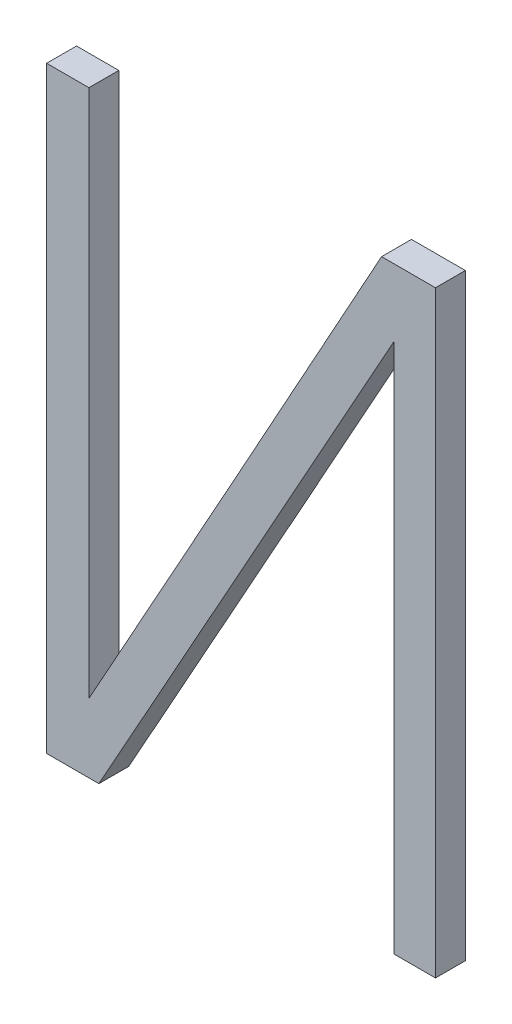
ISO-10303-21;
HEADER;
FILE_DESCRIPTION(('STEP AP214'),'2;1');
FILE_NAME('part.step','',(''),(''),'','','');
FILE_SCHEMA(('AUTOMOTIVE_DESIGN { 1 0 10303 214 1 1 1 1 }'));
ENDSEC;
DATA;
#1=APPLICATION_CONTEXT('core data for automotive mechanical design processes');
#2=APPLICATION_PROTOCOL_DEFINITION('international standard','automotive_design',2000,#1);
#3=PRODUCT_CONTEXT('',#1,'mechanical');
#4=PRODUCT('Part','Part','',(#3));
#5=PRODUCT_RELATED_PRODUCT_CATEGORY('part','',(#4));
#6=PRODUCT_DEFINITION_FORMATION('','',#4);
#7=PRODUCT_DEFINITION_CONTEXT('part definition',#1,'design');
#8=PRODUCT_DEFINITION('design','',#6,#7);
#9=PRODUCT_DEFINITION_SHAPE('','',#8);
#10=(LENGTH_UNIT() NAMED_UNIT(*) SI_UNIT(.MILLI.,.METRE.));
#11=(NAMED_UNIT(*) PLANE_ANGLE_UNIT() SI_UNIT($,.RADIAN.));
#12=(NAMED_UNIT(*) SI_UNIT($,.STERADIAN.) SOLID_ANGLE_UNIT());
#13=UNCERTAINTY_MEASURE_WITH_UNIT(LENGTH_MEASURE(1.E-05),#10,'distance_accuracy_value','');
#14=(GEOMETRIC_REPRESENTATION_CONTEXT(3) GLOBAL_UNCERTAINTY_ASSIGNED_CONTEXT((#13)) GLOBAL_UNIT_ASSIGNED_CONTEXT((#10,
#11,#12)) REPRESENTATION_CONTEXT('',''));
#15=CARTESIAN_POINT('',(0.,0.,0.));
#16=DIRECTION('',(0.,0.,1.));
#17=DIRECTION('',(1.,0.,0.));
#18=AXIS2_PLACEMENT_3D('',#15,#16,#17);
#19=CARTESIAN_POINT('',(70.8180545018474,66.6666929015237,-39.));
#20=DIRECTION('',(0.,0.,1.));
#21=DIRECTION('',(1.,0.,0.));
#22=AXIS2_PLACEMENT_3D('',#19,#20,#21);
#23=PLANE('',#22);
#24=DIRECTION('',(0.,1.,0.));
#25=VECTOR('',#24,1.);
#26=CARTESIAN_POINT('',(70.2907389974903,66.0094130057811,-39.));
#27=LINE('',#26,#25);
#28=CARTESIAN_POINT('',(70.2907389974903,66.0094130057811,-39.));
#29=VERTEX_POINT('',#28);
#30=CARTESIAN_POINT('',(70.2907389974903,67.7791772221511,-39.));
#31=VERTEX_POINT('',#30);
#32=EDGE_CURVE('E153',#29,#31,#27,.T.);
#33=ORIENTED_EDGE('',*,*,#32,.T.);
#34=DIRECTION('',(1.,0.,0.));
#35=VECTOR('',#34,1.);
#36=CARTESIAN_POINT('',(70.2907389974903,67.7791772221511,-39.));
#37=LINE('',#36,#35);
#38=CARTESIAN_POINT('',(70.1492688171903,67.7791772221511,-39.));
#39=VERTEX_POINT('',#38);
#40=EDGE_CURVE('E146',#31,#39,#37,.F.);
#41=ORIENTED_EDGE('',*,*,#40,.T.);
#42=DIRECTION('',(0.,1.,0.));
#43=VECTOR('',#42,1.);
#44=CARTESIAN_POINT('',(70.1492688171903,67.7791772221511,-39.));
#45=LINE('',#44,#43);
#46=CARTESIAN_POINT('',(70.1492688171903,65.7791772221511,-39.));
#47=VERTEX_POINT('',#46);
#48=EDGE_CURVE('E134',#39,#47,#45,.F.);
#49=ORIENTED_EDGE('',*,*,#48,.T.);
#50=DIRECTION('',(1.,0.,0.));
#51=VECTOR('',#50,1.);
#52=CARTESIAN_POINT('',(70.1492688171903,65.7791772221511,-39.));
#53=LINE('',#52,#51);
#54=CARTESIAN_POINT('',(70.3240260986903,65.7791772221511,-39.));
#55=VERTEX_POINT('',#54);
#56=EDGE_CURVE('E99',#47,#55,#53,.T.);
#57=ORIENTED_EDGE('',*,*,#56,.T.);
#58=CARTESIAN_POINT('',(70.3240260986903,65.7791772221511,-39.));
#59=CARTESIAN_POINT('',(70.3563927934447,65.837459689315,-39.));
#60=CARTESIAN_POINT('',(70.3887963568092,65.8957216335472,-39.));
#61=CARTESIAN_POINT('',(70.4536339556095,66.012228560701,-39.));
#62=CARTESIAN_POINT('',(70.486067991042,66.0704735436245,-39.));
#63=CARTESIAN_POINT('',(70.5509232754195,66.1869706445384,-39.));
#64=CARTESIAN_POINT('',(70.5833445243647,66.2452227625288,-39.));
#65=CARTESIAN_POINT('',(70.6481045079244,66.361772876056,-39.));
#66=CARTESIAN_POINT('',(70.6804432424916,66.4200708716192,-39.));
#67=CARTESIAN_POINT('',(70.7290399186195,66.5074687178231,-39.));
#68=CARTESIAN_POINT('',(70.7452535745558,66.5365931447446,-39.));
#69=CARTESIAN_POINT('',(70.7777641237289,66.5947955301841,-39.));
#70=CARTESIAN_POINT('',(70.7940610170486,66.6238734886556,-39.));
#71=CARTESIAN_POINT('',(70.8208593902973,66.6716999897548,-39.));
#72=CARTESIAN_POINT('',(70.8313625598594,66.6904475920111,-39.));
#73=CARTESIAN_POINT('',(70.8523331695412,66.7279627555647,-39.));
#74=CARTESIAN_POINT('',(70.8628006096959,66.7467303168424,-39.));
#75=CARTESIAN_POINT('',(70.894167229785,66.8030528444616,-39.));
#76=CARTESIAN_POINT('',(70.9150307198838,66.8406276734024,-39.));
#77=CARTESIAN_POINT('',(70.9567096225319,66.9158039657227,-39.));
#78=CARTESIAN_POINT('',(70.9775250350749,66.9534054291057,-39.));
#79=CARTESIAN_POINT('',(71.0192098854936,67.0285783709688,-39.));
#80=CARTESIAN_POINT('',(71.0400793233256,67.0661498494732,-39.));
#81=CARTESIAN_POINT('',(71.0818676701765,67.1412654157379,-39.));
#82=CARTESIAN_POINT('',(71.1027865793193,67.1788095034293,-39.));
#83=CARTESIAN_POINT('',(71.1342193628217,67.2350952187691,-39.));
#84=CARTESIAN_POINT('',(71.1447060225268,67.2538520460306,-39.));
#85=CARTESIAN_POINT('',(71.16569341081,67.2913579090595,-39.));
#86=CARTESIAN_POINT('',(71.1761941394308,67.3101069448029,-39.));
#87=CARTESIAN_POINT('',(71.19724069644,67.3475804909405,-39.));
#88=CARTESIAN_POINT('',(71.2077865262341,67.3663050005459,-39.));
#89=CARTESIAN_POINT('',(71.2288950331622,67.4037438978649,-39.));
#90=CARTESIAN_POINT('',(71.2394577099506,67.4224582857757,-39.));
#91=CARTESIAN_POINT('',(71.2605145442234,67.4599265350689,-39.));
#92=CARTESIAN_POINT('',(71.2710087004665,67.4786803971582,-39.));
#93=CARTESIAN_POINT('',(71.286499081474,67.5069507879104,-39.));
#94=CARTESIAN_POINT('',(71.29162093136,67.5163978957492,-39.));
#95=CARTESIAN_POINT('',(71.3017131023109,67.535373910361,-39.));
#96=CARTESIAN_POINT('',(71.3066834053565,67.54490282669,-39.));
#97=CARTESIAN_POINT('',(71.3115434356903,67.5544892887211,-39.));
#98=B_SPLINE_CURVE_WITH_KNOTS('',3,(#58,#59,#60,#61,#62,#63,#64,#65,#66,#67,#68,#69,#70,#71,#72,
#73,#74,#75,#76,#77,#78,#79,#80,#81,#82,#83,#84,#85,#86,#87,#88,#89,#90,#91,#92,#93,#94,#95,#96,
#97),.UNSPECIFIED.,.F.,.F.,(4,2,2,2,2,2,2,2,2,2,2,2,2,2,2,2,2,2,2,4),(0.,0.200000028553262,
0.400000035734683,0.600000040782737,0.800000160344128,0.900000238752935,1.00000041703692,
1.06446824939895,1.12893601844823,1.25787149185408,1.38680698224139,1.51574236833358,
1.64467807787353,1.70914587426554,1.77361386735012,1.8380838847435,1.90255259649366,
1.96702247280524,1.99925997182709,2.03150128915176),.UNSPECIFIED.);
#99=CARTESIAN_POINT('',(71.3115434356903,67.5544892887211,-39.));
#100=VERTEX_POINT('',#99);
#101=EDGE_CURVE('E24',#55,#100,#98,.T.);
#102=ORIENTED_EDGE('',*,*,#101,.T.);
#103=DIRECTION('',(0.,1.,0.));
#104=VECTOR('',#103,1.);
#105=CARTESIAN_POINT('',(71.3115434356903,67.5544892887211,-39.));
#106=LINE('',#105,#104);
#107=CARTESIAN_POINT('',(71.3115434356903,65.7791772221511,-39.));
#108=VERTEX_POINT('',#107);
#109=EDGE_CURVE('E102',#100,#108,#106,.F.);
#110=ORIENTED_EDGE('',*,*,#109,.T.);
#111=DIRECTION('',(1.,0.,0.));
#112=VECTOR('',#111,1.);
#113=CARTESIAN_POINT('',(71.3115434356903,65.7791772221511,-39.));
#114=LINE('',#113,#112);
#115=CARTESIAN_POINT('',(71.4502396908903,65.7791772221511,-39.));
#116=VERTEX_POINT('',#115);
#117=EDGE_CURVE('E169',#108,#116,#114,.T.);
#118=ORIENTED_EDGE('',*,*,#117,.T.);
#119=DIRECTION('',(0.,1.,0.));
#120=VECTOR('',#119,1.);
#121=CARTESIAN_POINT('',(71.4502396908903,65.7791772221511,-39.));
#122=LINE('',#121,#120);
#123=CARTESIAN_POINT('',(71.4502396908903,67.7791772221511,-39.));
#124=VERTEX_POINT('',#123);
#125=EDGE_CURVE('E164',#116,#124,#122,.T.);
#126=ORIENTED_EDGE('',*,*,#125,.T.);
#127=DIRECTION('',(1.,0.,0.));
#128=VECTOR('',#127,1.);
#129=CARTESIAN_POINT('',(71.4502396908903,67.7791772221511,-39.));
#130=LINE('',#129,#128);
#131=CARTESIAN_POINT('',(71.2699345591903,67.7791772221511,-39.));
#132=VERTEX_POINT('',#131);
#133=EDGE_CURVE('E158',#124,#132,#130,.F.);
#134=ORIENTED_EDGE('',*,*,#133,.T.);
#135=CARTESIAN_POINT('',(71.2699345591903,67.7791772221511,-39.));
#136=CARTESIAN_POINT('',(71.2377783414924,67.7207784148579,-39.));
#137=CARTESIAN_POINT('',(71.2056144979218,67.6623837890544,-39.));
#138=CARTESIAN_POINT('',(71.0447466887797,67.3704373036202,-39.));
#139=CARTESIAN_POINT('',(70.9158970675842,67.1369655895566,-39.));
#140=CARTESIAN_POINT('',(70.7661248782186,66.8663750185796,-39.));
#141=CARTESIAN_POINT('',(70.7454837115606,66.829100414498,-39.));
#142=CARTESIAN_POINT('',(70.7042124821858,66.7545450561541,-39.));
#143=CARTESIAN_POINT('',(70.683582419472,66.71726430189,-39.));
#144=CARTESIAN_POINT('',(70.6216652120764,66.6054369385851,-39.));
#145=CARTESIAN_POINT('',(70.5803510471842,66.5309052273021,-39.));
#146=CARTESIAN_POINT('',(70.5181875312402,66.4192145943603,-39.));
#147=CARTESIAN_POINT('',(70.4974343025683,66.3820021844605,-39.));
#148=CARTESIAN_POINT('',(70.4559269809738,66.3075777762562,-39.));
#149=CARTESIAN_POINT('',(70.4351728880497,66.2703657779527,-39.));
#150=CARTESIAN_POINT('',(70.4040447202124,66.2145460266115,-39.));
#151=CARTESIAN_POINT('',(70.3936691455026,66.1959391253655,-39.));
#152=CARTESIAN_POINT('',(70.3729282831543,66.1587197430429,-39.));
#153=CARTESIAN_POINT('',(70.3625629954704,66.1401072619914,-39.));
#154=CARTESIAN_POINT('',(70.3418651430086,66.1028637020908,-39.));
#155=CARTESIAN_POINT('',(70.3315325785103,66.0842326230846,-39.));
#156=CARTESIAN_POINT('',(70.3110056778948,66.0468942631464,-39.));
#157=CARTESIAN_POINT('',(70.3008113439394,66.0281869810287,-39.));
#158=CARTESIAN_POINT('',(70.2907389974903,66.0094130057811,-39.));
#159=B_SPLINE_CURVE_WITH_KNOTS('',3,(#135,#136,#137,#138,#139,#140,#141,#142,#143,#144,#145,
#146,#147,#148,#149,#150,#151,#152,#153,#154,#155,#156,#157,#158),.UNSPECIFIED.,.F.,.F.,(4,2,2,
2,2,2,2,2,2,2,2,4),(0.,0.20000000428509,1.00000026663452,1.12782468990254,1.25564914912757,
1.51129806164908,1.63912266410603,1.76694752205482,1.83086012380522,1.89477244286558,
1.9586853065778,2.02259916863615),.UNSPECIFIED.);
#160=EDGE_CURVE('E229',#132,#29,#159,.T.);
#161=ORIENTED_EDGE('',*,*,#160,.T.);
#162=EDGE_LOOP('',(#33,#41,#49,#57,#102,#110,#118,#126,#134,#161));
#163=FACE_BOUND('',#162,.T.);
#164=ADVANCED_FACE('F17',(#163),#23,.T.);
#165=CARTESIAN_POINT('',(70.1492688171903,65.7791772221511,-39.));
#166=DIRECTION('',(0.,1.,0.));
#167=DIRECTION('',(0.,0.,1.));
#168=AXIS2_PLACEMENT_3D('',#165,#166,#167);
#169=PLANE('',#168);
#170=DIRECTION('',(0.,0.,1.));
#171=VECTOR('',#170,1.);
#172=CARTESIAN_POINT('',(70.3240260986903,65.7791772221511,-39.05));
#173=LINE('',#172,#171);
#174=CARTESIAN_POINT('',(70.3240260986903,65.7791772221511,-39.1));
#175=VERTEX_POINT('',#174);
#176=EDGE_CURVE('E108',#175,#55,#173,.T.);
#177=ORIENTED_EDGE('',*,*,#176,.T.);
#178=ORIENTED_EDGE('',*,*,#56,.F.);
#179=DIRECTION('',(0.,0.,-1.));
#180=VECTOR('',#179,1.);
#181=CARTESIAN_POINT('',(70.1492688171903,65.7791772221511,-39.));
#182=LINE('',#181,#180);
#183=CARTESIAN_POINT('',(70.1492688171903,65.7791772221511,-39.1));
#184=VERTEX_POINT('',#183);
#185=EDGE_CURVE('E129',#47,#184,#182,.T.);
#186=ORIENTED_EDGE('',*,*,#185,.T.);
#187=DIRECTION('',(1.,0.,0.));
#188=VECTOR('',#187,1.);
#189=CARTESIAN_POINT('',(70.8180545018474,65.7791772221511,-39.1));
#190=LINE('',#189,#188);
#191=EDGE_CURVE('E126',#184,#175,#190,.T.);
#192=ORIENTED_EDGE('',*,*,#191,.T.);
#193=EDGE_LOOP('',(#177,#178,#186,#192));
#194=FACE_BOUND('',#193,.T.);
#195=ADVANCED_FACE('F220',(#194),#169,.F.);
#196=CARTESIAN_POINT('',(70.3240260986903,65.7791772221511,-39.));
#197=CARTESIAN_POINT('',(70.3240260986903,65.7791772221511,-39.1));
#198=CARTESIAN_POINT('',(70.3772767749903,65.8750710151511,-39.));
#199=CARTESIAN_POINT('',(70.3772767749903,65.8750710151511,-39.1));
#200=CARTESIAN_POINT('',(70.4809022921903,66.0611955455411,-39.));
#201=CARTESIAN_POINT('',(70.4809022921903,66.0611955455411,-39.1));
#202=CARTESIAN_POINT('',(70.6317076008903,66.3320660251411,-39.));
#203=CARTESIAN_POINT('',(70.6317076008903,66.3320660251411,-39.1));
#204=CARTESIAN_POINT('',(70.7482882971903,66.5424096599711,-39.));
#205=CARTESIAN_POINT('',(70.7482882971903,66.5424096599711,-39.1));
#206=CARTESIAN_POINT('',(70.8349654430903,66.6967622067311,-39.));
#207=CARTESIAN_POINT('',(70.8349654430903,66.6967622067311,-39.1));
#208=CARTESIAN_POINT('',(70.8931965118903,66.8012589920711,-39.));
#209=CARTESIAN_POINT('',(70.8931965118903,66.8012589920711,-39.1));
#210=CARTESIAN_POINT('',(70.9503980907903,66.9043981850211,-39.));
#211=CARTESIAN_POINT('',(70.9503980907903,66.9043981850211,-39.1));
#212=CARTESIAN_POINT('',(71.0058916061903,67.0046163553611,-39.));
#213=CARTESIAN_POINT('',(71.0058916061903,67.0046163553611,-39.1));
#214=CARTESIAN_POINT('',(71.0590647494903,67.1003133886412,-39.));
#215=CARTESIAN_POINT('',(71.0590647494903,67.1003133886412,-39.1));
#216=CARTESIAN_POINT('',(71.1091928040903,67.1903164341511,-39.));
#217=CARTESIAN_POINT('',(71.1091928040903,67.1903164341511,-39.1));
#218=CARTESIAN_POINT('',(71.1557841203903,67.2736885987511,-39.));
#219=CARTESIAN_POINT('',(71.1557841203903,67.2736885987511,-39.1));
#220=CARTESIAN_POINT('',(71.1982896836903,67.3495250564411,-39.));
#221=CARTESIAN_POINT('',(71.1982896836903,67.3495250564411,-39.1));
#222=CARTESIAN_POINT('',(71.2360991403903,67.4164740667512,-39.));
#223=CARTESIAN_POINT('',(71.2360991403903,67.4164740667512,-39.1));
#224=CARTESIAN_POINT('',(71.2679294682903,67.4730811253211,-39.));
#225=CARTESIAN_POINT('',(71.2679294682903,67.4730811253211,-39.1));
#226=CARTESIAN_POINT('',(71.2925538677903,67.5178676464511,-39.));
#227=CARTESIAN_POINT('',(71.2925538677903,67.5178676464511,-39.1));
#228=CARTESIAN_POINT('',(71.3060645609903,67.5436895612412,-39.));
#229=CARTESIAN_POINT('',(71.3060645609903,67.5436895612412,-39.1));
#230=CARTESIAN_POINT('',(71.3115434356903,67.5544892887211,-39.));
#231=CARTESIAN_POINT('',(71.3115434356903,67.5544892887211,-39.1));
#232=B_SPLINE_SURFACE_WITH_KNOTS('',3,1,((#196,#197),(#198,#199),(#200,#201),(#202,#203),(#204,
#205),(#206,#207),(#208,#209),(#210,#211),(#212,#213),(#214,#215),(#216,#217),(#218,#219),(#220,
#221),(#222,#223),(#224,#225),(#226,#227),(#228,#229),(#230,#231)),.UNSPECIFIED.,.F.,.F.,.F.,(4,
1,1,1,1,1,1,1,1,1,1,1,1,1,1,4),(2,2),(0.,0.1619791360498,0.314586119726,0.4578209512225,
0.517119340157,0.5760048260433,0.6344776424312,0.691285303693,0.7451751883624,0.7961473611019,
0.84342088792,0.8862148614467,0.92452942342535,0.95696377389063,0.98211890272251,1.),(1.,1.1),.UNSPECIFIED.);
#233=DIRECTION('',(0.,0.,-1.));
#234=VECTOR('',#233,1.);
#235=CARTESIAN_POINT('',(71.3115434356903,67.5544892887211,-39.));
#236=LINE('',#235,#234);
#237=CARTESIAN_POINT('',(71.3115434356903,67.5544892887211,-39.1));
#238=VERTEX_POINT('',#237);
#239=EDGE_CURVE('E107',#238,#100,#236,.F.);
#240=CARTESIAN_POINT('',(70.3240260986903,65.7791772221511,-39.1));
#241=CARTESIAN_POINT('',(70.3563927934447,65.837459689315,-39.1));
#242=CARTESIAN_POINT('',(70.3887963568092,65.8957216335472,-39.1));
#243=CARTESIAN_POINT('',(70.4536339556095,66.012228560701,-39.1));
#244=CARTESIAN_POINT('',(70.486067991042,66.0704735436245,-39.1));
#245=CARTESIAN_POINT('',(70.5509232754196,66.1869706445384,-39.1));
#246=CARTESIAN_POINT('',(70.5833445243647,66.2452227625288,-39.1));
#247=CARTESIAN_POINT('',(70.6481045079244,66.361772876056,-39.1));
#248=CARTESIAN_POINT('',(70.6804432424916,66.4200708716192,-39.1));
#249=CARTESIAN_POINT('',(70.7290399186195,66.5074687178231,-39.1));
#250=CARTESIAN_POINT('',(70.7452535745558,66.5365931447446,-39.1));
#251=CARTESIAN_POINT('',(70.7777641237289,66.5947955301841,-39.1));
#252=CARTESIAN_POINT('',(70.7940610170486,66.6238734886556,-39.1));
#253=CARTESIAN_POINT('',(70.8208593902973,66.6716999897548,-39.1));
#254=CARTESIAN_POINT('',(70.8313625598594,66.6904475920111,-39.1));
#255=CARTESIAN_POINT('',(70.8523331695412,66.7279627555647,-39.1));
#256=CARTESIAN_POINT('',(70.8628006096959,66.7467303168423,-39.1));
#257=CARTESIAN_POINT('',(70.894167229785,66.8030528444616,-39.1));
#258=CARTESIAN_POINT('',(70.9150307198838,66.8406276734024,-39.1));
#259=CARTESIAN_POINT('',(70.9567096225319,66.9158039657227,-39.1));
#260=CARTESIAN_POINT('',(70.9775250350749,66.9534054291057,-39.1));
#261=CARTESIAN_POINT('',(71.0192098854936,67.0285783709688,-39.1));
#262=CARTESIAN_POINT('',(71.0400793233256,67.0661498494732,-39.1));
#263=CARTESIAN_POINT('',(71.0818676701765,67.1412654157379,-39.1));
#264=CARTESIAN_POINT('',(71.1027865793193,67.1788095034293,-39.1));
#265=CARTESIAN_POINT('',(71.1342193628217,67.2350952187691,-39.1));
#266=CARTESIAN_POINT('',(71.1447060225268,67.2538520460306,-39.1));
#267=CARTESIAN_POINT('',(71.16569341081,67.2913579090595,-39.1));
#268=CARTESIAN_POINT('',(71.1761941394308,67.310106944803,-39.1));
#269=CARTESIAN_POINT('',(71.19724069644,67.3475804909405,-39.1));
#270=CARTESIAN_POINT('',(71.2077865262341,67.3663050005459,-39.1));
#271=CARTESIAN_POINT('',(71.2288950331622,67.4037438978649,-39.1));
#272=CARTESIAN_POINT('',(71.2394577099506,67.4224582857757,-39.1));
#273=CARTESIAN_POINT('',(71.2605145442234,67.4599265350689,-39.1));
#274=CARTESIAN_POINT('',(71.2710087004665,67.4786803971582,-39.1));
#275=CARTESIAN_POINT('',(71.286499081474,67.5069507879104,-39.1));
#276=CARTESIAN_POINT('',(71.29162093136,67.5163978957492,-39.1));
#277=CARTESIAN_POINT('',(71.3017131023109,67.535373910361,-39.1));
#278=CARTESIAN_POINT('',(71.3066834053565,67.54490282669,-39.1));
#279=CARTESIAN_POINT('',(71.3115434356903,67.5544892887211,-39.1));
#280=B_SPLINE_CURVE_WITH_KNOTS('',3,(#240,#241,#242,#243,#244,#245,#246,#247,#248,#249,#250,
#251,#252,#253,#254,#255,#256,#257,#258,#259,#260,#261,#262,#263,#264,#265,#266,#267,#268,#269,
#270,#271,#272,#273,#274,#275,#276,#277,#278,#279),.UNSPECIFIED.,.F.,.F.,(4,2,2,2,2,2,2,2,2,2,2,
2,2,2,2,2,2,2,2,4),(0.,0.200000028553262,0.400000035734678,0.60000004078273,0.800000160344128,
0.900000238752935,1.00000041703692,1.06446824939895,1.12893601844822,1.25787149185407,
1.38680698224139,1.51574236833358,1.64467807787354,1.70914587426555,1.77361386735013,
1.8380838847435,1.90255259649365,1.96702247280524,1.99925997182709,2.03150128915176),.UNSPECIFIED.);
#281=EDGE_CURVE('E119',#175,#238,#280,.T.);
#282=ORIENTED_EDGE('',*,*,#239,.T.);
#283=ORIENTED_EDGE('',*,*,#101,.F.);
#284=ORIENTED_EDGE('',*,*,#176,.F.);
#285=ORIENTED_EDGE('',*,*,#281,.T.);
#286=EDGE_LOOP('',(#282,#283,#284,#285));
#287=FACE_BOUND('',#286,.T.);
#288=ADVANCED_FACE('F117',(#287),#232,.F.);
#289=CARTESIAN_POINT('',(71.3115434356903,67.5544892887211,-39.));
#290=DIRECTION('',(1.,0.,0.));
#291=DIRECTION('',(0.,0.,-1.));
#292=AXIS2_PLACEMENT_3D('',#289,#290,#291);
#293=PLANE('',#292);
#294=DIRECTION('',(0.,0.,1.));
#295=VECTOR('',#294,1.);
#296=CARTESIAN_POINT('',(71.3115434356903,65.7791772221511,-39.));
#297=LINE('',#296,#295);
#298=CARTESIAN_POINT('',(71.3115434356903,65.7791772221511,-39.1));
#299=VERTEX_POINT('',#298);
#300=EDGE_CURVE('E114',#299,#108,#297,.T.);
#301=ORIENTED_EDGE('',*,*,#300,.T.);
#302=ORIENTED_EDGE('',*,*,#109,.F.);
#303=ORIENTED_EDGE('',*,*,#239,.F.);
#304=DIRECTION('',(0.,1.,0.));
#305=VECTOR('',#304,1.);
#306=CARTESIAN_POINT('',(71.3115434356903,66.6666929015237,-39.1));
#307=LINE('',#306,#305);
#308=EDGE_CURVE('E262',#238,#299,#307,.F.);
#309=ORIENTED_EDGE('',*,*,#308,.T.);
#310=EDGE_LOOP('',(#301,#302,#303,#309));
#311=FACE_BOUND('',#310,.T.);
#312=ADVANCED_FACE('F111',(#311),#293,.F.);
#313=CARTESIAN_POINT('',(71.3115434356903,65.7791772221511,-39.));
#314=DIRECTION('',(0.,1.,0.));
#315=DIRECTION('',(0.,0.,1.));
#316=AXIS2_PLACEMENT_3D('',#313,#314,#315);
#317=PLANE('',#316);
#318=DIRECTION('',(0.,0.,1.));
#319=VECTOR('',#318,1.);
#320=CARTESIAN_POINT('',(71.4502396908903,65.7791772221511,-39.));
#321=LINE('',#320,#319);
#322=CARTESIAN_POINT('',(71.4502396908903,65.7791772221511,-39.1));
#323=VERTEX_POINT('',#322);
#324=EDGE_CURVE('E166',#323,#116,#321,.T.);
#325=ORIENTED_EDGE('',*,*,#324,.T.);
#326=ORIENTED_EDGE('',*,*,#117,.F.);
#327=ORIENTED_EDGE('',*,*,#300,.F.);
#328=DIRECTION('',(1.,0.,0.));
#329=VECTOR('',#328,1.);
#330=CARTESIAN_POINT('',(70.8180545018474,65.7791772221511,-39.1));
#331=LINE('',#330,#329);
#332=EDGE_CURVE('E253',#299,#323,#331,.T.);
#333=ORIENTED_EDGE('',*,*,#332,.T.);
#334=EDGE_LOOP('',(#325,#326,#327,#333));
#335=FACE_BOUND('',#334,.T.);
#336=ADVANCED_FACE('F213',(#335),#317,.F.);
#337=CARTESIAN_POINT('',(71.4502396908903,65.7791772221511,-39.));
#338=DIRECTION('',(-1.,0.,0.));
#339=DIRECTION('',(0.,0.,1.));
#340=AXIS2_PLACEMENT_3D('',#337,#338,#339);
#341=PLANE('',#340);
#342=DIRECTION('',(0.,0.,-1.));
#343=VECTOR('',#342,1.);
#344=CARTESIAN_POINT('',(71.4502396908903,67.7791772221511,-39.));
#345=LINE('',#344,#343);
#346=CARTESIAN_POINT('',(71.4502396908903,67.7791772221511,-39.1));
#347=VERTEX_POINT('',#346);
#348=EDGE_CURVE('E161',#347,#124,#345,.F.);
#349=ORIENTED_EDGE('',*,*,#348,.T.);
#350=ORIENTED_EDGE('',*,*,#125,.F.);
#351=ORIENTED_EDGE('',*,*,#324,.F.);
#352=DIRECTION('',(0.,1.,0.));
#353=VECTOR('',#352,1.);
#354=CARTESIAN_POINT('',(71.4502396908903,66.6666929015237,-39.1));
#355=LINE('',#354,#353);
#356=EDGE_CURVE('E250',#323,#347,#355,.T.);
#357=ORIENTED_EDGE('',*,*,#356,.T.);
#358=EDGE_LOOP('',(#349,#350,#351,#357));
#359=FACE_BOUND('',#358,.T.);
#360=ADVANCED_FACE('F209',(#359),#341,.F.);
#361=CARTESIAN_POINT('',(71.4502396908903,67.7791772221511,-39.));
#362=DIRECTION('',(0.,-1.,0.));
#363=DIRECTION('',(0.,0.,-1.));
#364=AXIS2_PLACEMENT_3D('',#361,#362,#363);
#365=PLANE('',#364);
#366=DIRECTION('',(0.,0.,1.));
#367=VECTOR('',#366,1.);
#368=CARTESIAN_POINT('',(71.2699345591903,67.7791772221511,-39.05));
#369=LINE('',#368,#367);
#370=CARTESIAN_POINT('',(71.2699345591903,67.7791772221511,-39.1));
#371=VERTEX_POINT('',#370);
#372=EDGE_CURVE('E160',#371,#132,#369,.T.);
#373=ORIENTED_EDGE('',*,*,#372,.T.);
#374=ORIENTED_EDGE('',*,*,#133,.F.);
#375=ORIENTED_EDGE('',*,*,#348,.F.);
#376=DIRECTION('',(1.,0.,0.));
#377=VECTOR('',#376,1.);
#378=CARTESIAN_POINT('',(70.8180545018474,67.7791772221511,-39.1));
#379=LINE('',#378,#377);
#380=EDGE_CURVE('E184',#347,#371,#379,.F.);
#381=ORIENTED_EDGE('',*,*,#380,.T.);
#382=EDGE_LOOP('',(#373,#374,#375,#381));
#383=FACE_BOUND('',#382,.T.);
#384=ADVANCED_FACE('F206',(#383),#365,.F.);
#385=CARTESIAN_POINT('',(71.2699345591903,67.7791772221511,-39.));
#386=CARTESIAN_POINT('',(71.2699345591903,67.7791772221511,-39.1));
#387=CARTESIAN_POINT('',(71.2177748419903,67.6844356329711,-39.));
#388=CARTESIAN_POINT('',(71.2177748419903,67.6844356329711,-39.1));
#389=CARTESIAN_POINT('',(71.1163177884903,67.5003026980511,-39.));
#390=CARTESIAN_POINT('',(71.1163177884903,67.5003026980511,-39.1));
#391=CARTESIAN_POINT('',(70.9683709160903,67.2321588749211,-39.));
#392=CARTESIAN_POINT('',(70.9683709160903,67.2321588749211,-39.1));
#393=CARTESIAN_POINT('',(70.8535166172903,67.0242134116511,-39.));
#394=CARTESIAN_POINT('',(70.8535166172903,67.0242134116511,-39.1));
#395=CARTESIAN_POINT('',(70.7687763938903,66.8711803787111,-39.));
#396=CARTESIAN_POINT('',(70.7687763938903,66.8711803787111,-39.1));
#397=CARTESIAN_POINT('',(70.7114495733903,66.7676199748911,-39.));
#398=CARTESIAN_POINT('',(70.7114495733903,66.7676199748911,-39.1));
#399=CARTESIAN_POINT('',(70.6546095317903,66.6649192993611,-39.));
#400=CARTESIAN_POINT('',(70.6546095317903,66.6649192993611,-39.1));
#401=CARTESIAN_POINT('',(70.5991590816903,66.5648369337011,-39.));
#402=CARTESIAN_POINT('',(70.5991590816903,66.5648369337011,-39.1));
#403=CARTESIAN_POINT('',(70.5459962107903,66.4691341930611,-39.));
#404=CARTESIAN_POINT('',(70.5459962107903,66.4691341930611,-39.1));
#405=CARTESIAN_POINT('',(70.4958296926903,66.3791012417811,-39.));
#406=CARTESIAN_POINT('',(70.4958296926903,66.3791012417811,-39.1));
#407=CARTESIAN_POINT('',(70.4492018393903,66.2955440812411,-39.));
#408=CARTESIAN_POINT('',(70.4492018393903,66.2955440812411,-39.1));
#409=CARTESIAN_POINT('',(70.4066760143903,66.2192568601611,-39.));
#410=CARTESIAN_POINT('',(70.4066760143903,66.2192568601611,-39.1));
#411=CARTESIAN_POINT('',(70.3688761519903,66.1514740691312,-39.));
#412=CARTESIAN_POINT('',(70.3688761519903,66.1514740691312,-39.1));
#413=CARTESIAN_POINT('',(70.3367690532903,66.0937131686911,-39.));
#414=CARTESIAN_POINT('',(70.3367690532903,66.0937131686911,-39.1));
#415=CARTESIAN_POINT('',(70.3112991557903,66.0475032570011,-39.));
#416=CARTESIAN_POINT('',(70.3112991557903,66.0475032570011,-39.1));
#417=CARTESIAN_POINT('',(70.2968056114903,66.0207393393111,-39.));
#418=CARTESIAN_POINT('',(70.2968056114903,66.0207393393111,-39.1));
#419=CARTESIAN_POINT('',(70.2907389974903,66.0094130057811,-39.));
#420=CARTESIAN_POINT('',(70.2907389974903,66.0094130057811,-39.1));
#421=B_SPLINE_SURFACE_WITH_KNOTS('',3,1,((#385,#386),(#387,#388),(#389,#390),(#391,#392),(#393,
#394),(#395,#396),(#397,#398),(#399,#400),(#401,#402),(#403,#404),(#405,#406),(#407,#408),(#409,
#410),(#411,#412),(#413,#414),(#415,#416),(#417,#418),(#419,#420)),.UNSPECIFIED.,.F.,.F.,.F.,(4,
1,1,1,1,1,1,1,1,1,1,1,1,1,1,4),(2,2),(0.,0.1604136079313,0.3118279074916,0.4542429547996,
0.5127659514206,0.5712889480415,0.6298119446625,0.6868696112471,0.7409966603715,0.7921931569825,
0.8397412565589,0.8829230595845,0.92173856758161,0.95485567872177,0.98094257721977,1.),(1.,1.1),.UNSPECIFIED.);
#422=DIRECTION('',(0.,0.,1.));
#423=VECTOR('',#422,1.);
#424=CARTESIAN_POINT('',(70.2907389974903,66.0094130057811,-39.));
#425=LINE('',#424,#423);
#426=CARTESIAN_POINT('',(70.2907389974903,66.0094130057811,-39.1));
#427=VERTEX_POINT('',#426);
#428=EDGE_CURVE('E155',#427,#29,#425,.T.);
#429=CARTESIAN_POINT('',(71.2699345591903,67.7791772221511,-39.1));
#430=CARTESIAN_POINT('',(71.2377783414924,67.720778414858,-39.1));
#431=CARTESIAN_POINT('',(71.2056144979218,67.6623837890544,-39.1));
#432=CARTESIAN_POINT('',(71.0447466887797,67.3704373036202,-39.1));
#433=CARTESIAN_POINT('',(70.9158970675843,67.1369655895566,-39.1));
#434=CARTESIAN_POINT('',(70.7661248782186,66.8663750185796,-39.1));
#435=CARTESIAN_POINT('',(70.7454837115606,66.829100414498,-39.1));
#436=CARTESIAN_POINT('',(70.7042124821857,66.7545450561541,-39.1));
#437=CARTESIAN_POINT('',(70.683582419472,66.71726430189,-39.1));
#438=CARTESIAN_POINT('',(70.6216652120764,66.6054369385851,-39.1));
#439=CARTESIAN_POINT('',(70.5803510471843,66.530905227302,-39.1));
#440=CARTESIAN_POINT('',(70.5181875312402,66.4192145943603,-39.1));
#441=CARTESIAN_POINT('',(70.4974343025683,66.3820021844604,-39.1));
#442=CARTESIAN_POINT('',(70.4559269809738,66.3075777762561,-39.1));
#443=CARTESIAN_POINT('',(70.4351728880497,66.2703657779527,-39.1));
#444=CARTESIAN_POINT('',(70.4040447202124,66.2145460266115,-39.1));
#445=CARTESIAN_POINT('',(70.3936691455026,66.1959391253655,-39.1));
#446=CARTESIAN_POINT('',(70.3729282831543,66.1587197430429,-39.1));
#447=CARTESIAN_POINT('',(70.3625629954704,66.1401072619914,-39.1));
#448=CARTESIAN_POINT('',(70.3418651430086,66.1028637020908,-39.1));
#449=CARTESIAN_POINT('',(70.3315325785103,66.0842326230846,-39.1));
#450=CARTESIAN_POINT('',(70.3110056778948,66.0468942631464,-39.1));
#451=CARTESIAN_POINT('',(70.3008113439394,66.0281869810287,-39.1));
#452=CARTESIAN_POINT('',(70.2907389974903,66.0094130057811,-39.1));
#453=B_SPLINE_CURVE_WITH_KNOTS('',3,(#429,#430,#431,#432,#433,#434,#435,#436,#437,#438,#439,
#440,#441,#442,#443,#444,#445,#446,#447,#448,#449,#450,#451,#452),.UNSPECIFIED.,.F.,.F.,(4,2,2,
2,2,2,2,2,2,2,2,4),(0.,0.20000000428509,1.00000026663452,1.12782468990254,1.25564914912757,
1.5112980616491,1.63912266410606,1.76694752205484,1.83086012380522,1.8947724428656,
1.9586853065778,2.02259916863615),.UNSPECIFIED.);
#454=EDGE_CURVE('E175',#371,#427,#453,.T.);
#455=ORIENTED_EDGE('',*,*,#428,.T.);
#456=ORIENTED_EDGE('',*,*,#160,.F.);
#457=ORIENTED_EDGE('',*,*,#372,.F.);
#458=ORIENTED_EDGE('',*,*,#454,.T.);
#459=EDGE_LOOP('',(#455,#456,#457,#458));
#460=FACE_BOUND('',#459,.T.);
#461=ADVANCED_FACE('F19',(#460),#421,.F.);
#462=CARTESIAN_POINT('',(70.2907389974903,66.0094130057811,-39.));
#463=DIRECTION('',(-1.,0.,0.));
#464=DIRECTION('',(0.,0.,1.));
#465=AXIS2_PLACEMENT_3D('',#462,#463,#464);
#466=PLANE('',#465);
#467=DIRECTION('',(0.,0.,-1.));
#468=VECTOR('',#467,1.);
#469=CARTESIAN_POINT('',(70.2907389974903,67.7791772221511,-39.));
#470=LINE('',#469,#468);
#471=CARTESIAN_POINT('',(70.2907389974903,67.7791772221511,-39.1));
#472=VERTEX_POINT('',#471);
#473=EDGE_CURVE('E150',#472,#31,#470,.F.);
#474=ORIENTED_EDGE('',*,*,#473,.T.);
#475=ORIENTED_EDGE('',*,*,#32,.F.);
#476=ORIENTED_EDGE('',*,*,#428,.F.);
#477=DIRECTION('',(0.,1.,0.));
#478=VECTOR('',#477,1.);
#479=CARTESIAN_POINT('',(70.2907389974903,66.6666929015237,-39.1));
#480=LINE('',#479,#478);
#481=EDGE_CURVE('E183',#427,#472,#480,.T.);
#482=ORIENTED_EDGE('',*,*,#481,.T.);
#483=EDGE_LOOP('',(#474,#475,#476,#482));
#484=FACE_BOUND('',#483,.T.);
#485=ADVANCED_FACE('F201',(#484),#466,.F.);
#486=CARTESIAN_POINT('',(70.2907389974903,67.7791772221511,-39.));
#487=DIRECTION('',(0.,-1.,0.));
#488=DIRECTION('',(0.,0.,-1.));
#489=AXIS2_PLACEMENT_3D('',#486,#487,#488);
#490=PLANE('',#489);
#491=DIRECTION('',(0.,0.,-1.));
#492=VECTOR('',#491,1.);
#493=CARTESIAN_POINT('',(70.1492688171903,67.7791772221511,-39.));
#494=LINE('',#493,#492);
#495=CARTESIAN_POINT('',(70.1492688171903,67.7791772221511,-39.1));
#496=VERTEX_POINT('',#495);
#497=EDGE_CURVE('E43',#496,#39,#494,.F.);
#498=ORIENTED_EDGE('',*,*,#497,.T.);
#499=ORIENTED_EDGE('',*,*,#40,.F.);
#500=ORIENTED_EDGE('',*,*,#473,.F.);
#501=DIRECTION('',(1.,0.,0.));
#502=VECTOR('',#501,1.);
#503=CARTESIAN_POINT('',(70.8180545018474,67.7791772221511,-39.1));
#504=LINE('',#503,#502);
#505=EDGE_CURVE('E35',#472,#496,#504,.F.);
#506=ORIENTED_EDGE('',*,*,#505,.T.);
#507=EDGE_LOOP('',(#498,#499,#500,#506));
#508=FACE_BOUND('',#507,.T.);
#509=ADVANCED_FACE('F198',(#508),#490,.F.);
#510=CARTESIAN_POINT('',(70.1492688171903,67.7791772221511,-39.));
#511=DIRECTION('',(1.,0.,0.));
#512=DIRECTION('',(0.,0.,-1.));
#513=AXIS2_PLACEMENT_3D('',#510,#511,#512);
#514=PLANE('',#513);
#515=ORIENTED_EDGE('',*,*,#185,.F.);
#516=ORIENTED_EDGE('',*,*,#48,.F.);
#517=ORIENTED_EDGE('',*,*,#497,.F.);
#518=DIRECTION('',(0.,1.,0.));
#519=VECTOR('',#518,1.);
#520=CARTESIAN_POINT('',(70.1492688171903,66.6666929015237,-39.1));
#521=LINE('',#520,#519);
#522=EDGE_CURVE('E11',#496,#184,#521,.F.);
#523=ORIENTED_EDGE('',*,*,#522,.T.);
#524=EDGE_LOOP('',(#515,#516,#517,#523));
#525=FACE_BOUND('',#524,.T.);
#526=ADVANCED_FACE('F193',(#525),#514,.F.);
#527=CARTESIAN_POINT('',(70.8180545018474,66.6666929015237,-39.1));
#528=DIRECTION('',(0.,0.,1.));
#529=DIRECTION('',(1.,0.,0.));
#530=AXIS2_PLACEMENT_3D('',#527,#528,#529);
#531=PLANE('',#530);
#532=ORIENTED_EDGE('',*,*,#505,.F.);
#533=ORIENTED_EDGE('',*,*,#481,.F.);
#534=ORIENTED_EDGE('',*,*,#454,.F.);
#535=ORIENTED_EDGE('',*,*,#380,.F.);
#536=ORIENTED_EDGE('',*,*,#356,.F.);
#537=ORIENTED_EDGE('',*,*,#332,.F.);
#538=ORIENTED_EDGE('',*,*,#308,.F.);
#539=ORIENTED_EDGE('',*,*,#281,.F.);
#540=ORIENTED_EDGE('',*,*,#191,.F.);
#541=ORIENTED_EDGE('',*,*,#522,.F.);
#542=EDGE_LOOP('',(#532,#533,#534,#535,#536,#537,#538,#539,#540,#541));
#543=FACE_BOUND('',#542,.T.);
#544=ADVANCED_FACE('F189',(#543),#531,.F.);
#545=CLOSED_SHELL('',(#164,#195,#288,#312,#336,#360,#384,#461,#485,#509,#526,#544));
#546=MANIFOLD_SOLID_BREP('B1',#545);
#547=ADVANCED_BREP_SHAPE_REPRESENTATION('',(#18,#546),#14);
#548=SHAPE_DEFINITION_REPRESENTATION(#9,#547);
ENDSEC;
END-ISO-10303-21;
